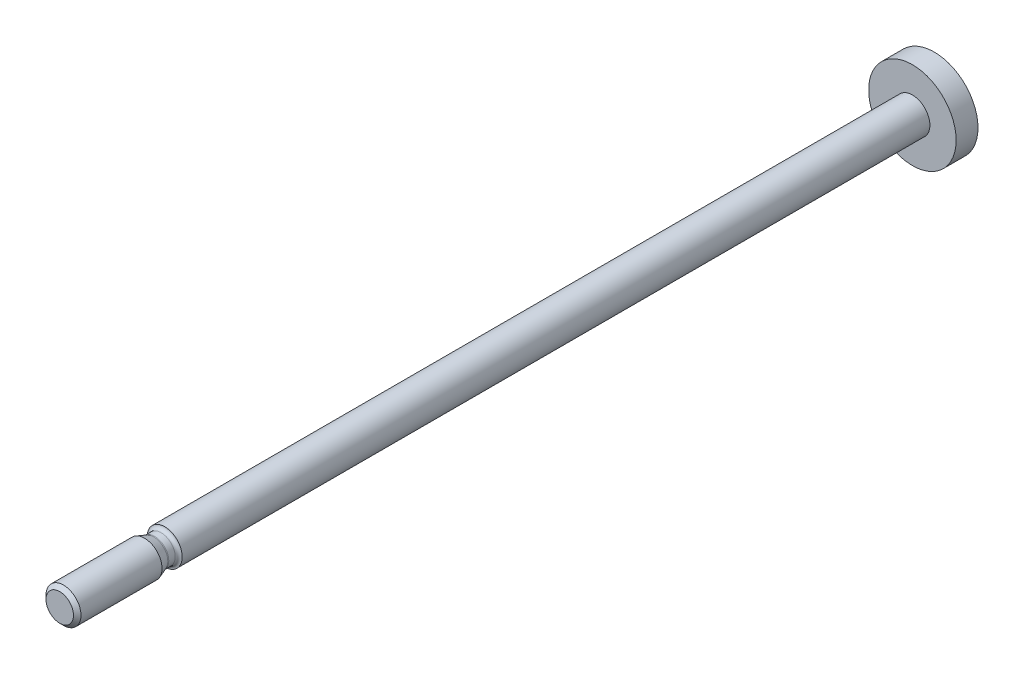
ISO-10303-21;
HEADER;
FILE_DESCRIPTION(('STEP AP214'),'2;1');
FILE_NAME('part.step','',(''),(''),'','','');
FILE_SCHEMA(('AUTOMOTIVE_DESIGN { 1 0 10303 214 1 1 1 1 }'));
ENDSEC;
DATA;
#1=APPLICATION_CONTEXT('core data for automotive mechanical design processes');
#2=APPLICATION_PROTOCOL_DEFINITION('international standard','automotive_design',2000,#1);
#3=PRODUCT_CONTEXT('',#1,'mechanical');
#4=PRODUCT('Part','Part','',(#3));
#5=PRODUCT_RELATED_PRODUCT_CATEGORY('part','',(#4));
#6=PRODUCT_DEFINITION_FORMATION('','',#4);
#7=PRODUCT_DEFINITION_CONTEXT('part definition',#1,'design');
#8=PRODUCT_DEFINITION('design','',#6,#7);
#9=PRODUCT_DEFINITION_SHAPE('','',#8);
#10=(LENGTH_UNIT() NAMED_UNIT(*) SI_UNIT(.MILLI.,.METRE.));
#11=(NAMED_UNIT(*) PLANE_ANGLE_UNIT() SI_UNIT($,.RADIAN.));
#12=(NAMED_UNIT(*) SI_UNIT($,.STERADIAN.) SOLID_ANGLE_UNIT());
#13=UNCERTAINTY_MEASURE_WITH_UNIT(LENGTH_MEASURE(1.E-05),#10,'distance_accuracy_value','');
#14=(GEOMETRIC_REPRESENTATION_CONTEXT(3) GLOBAL_UNCERTAINTY_ASSIGNED_CONTEXT((#13)) GLOBAL_UNIT_ASSIGNED_CONTEXT((#10,
#11,#12)) REPRESENTATION_CONTEXT('',''));
#15=CARTESIAN_POINT('',(0.,0.,0.));
#16=DIRECTION('',(0.,0.,1.));
#17=DIRECTION('',(1.,0.,0.));
#18=AXIS2_PLACEMENT_3D('',#15,#16,#17);
#19=CARTESIAN_POINT('',(0.,0.,-84.));
#20=DIRECTION('',(0.,0.,1.));
#21=DIRECTION('',(1.,0.,0.));
#22=AXIS2_PLACEMENT_3D('',#19,#20,#21);
#23=CYLINDRICAL_SURFACE('',#22,2.);
#24=CARTESIAN_POINT('',(0.,0.,4.));
#25=DIRECTION('',(0.,0.,1.));
#26=DIRECTION('',(1.,0.,0.));
#27=AXIS2_PLACEMENT_3D('',#24,#25,#26);
#28=CIRCLE('',#27,2.);
#29=CARTESIAN_POINT('',(2.,0.,4.));
#30=VERTEX_POINT('',#29);
#31=EDGE_CURVE('E10',#30,#30,#28,.T.);
#32=ORIENTED_EDGE('',*,*,#31,.F.);
#33=EDGE_LOOP('',(#32));
#34=FACE_BOUND('',#33,.T.);
#35=CARTESIAN_POINT('',(0.,0.,-81.5));
#36=DIRECTION('',(0.,0.,1.));
#37=DIRECTION('',(1.,0.,0.));
#38=AXIS2_PLACEMENT_3D('',#35,#36,#37);
#39=CIRCLE('',#38,2.);
#40=CARTESIAN_POINT('',(2.,0.,-81.5));
#41=VERTEX_POINT('',#40);
#42=EDGE_CURVE('E45',#41,#41,#39,.T.);
#43=ORIENTED_EDGE('',*,*,#42,.T.);
#44=EDGE_LOOP('',(#43));
#45=FACE_BOUND('',#44,.T.);
#46=ADVANCED_FACE('F39',(#34,#45),#23,.T.);
#47=CARTESIAN_POINT('',(0.,2.,-81.5));
#48=DIRECTION('',(0.,0.,-1.));
#49=DIRECTION('',(-1.,0.,0.));
#50=AXIS2_PLACEMENT_3D('',#47,#48,#49);
#51=PLANE('',#50);
#52=ORIENTED_EDGE('',*,*,#42,.F.);
#53=EDGE_LOOP('',(#52));
#54=FACE_BOUND('',#53,.T.);
#55=CARTESIAN_POINT('',(0.,0.,-81.5));
#56=DIRECTION('',(0.,0.,1.));
#57=DIRECTION('',(1.,0.,0.));
#58=AXIS2_PLACEMENT_3D('',#55,#56,#57);
#59=CIRCLE('',#58,5.);
#60=CARTESIAN_POINT('',(5.,0.,-81.5));
#61=VERTEX_POINT('',#60);
#62=EDGE_CURVE('E49',#61,#61,#59,.T.);
#63=ORIENTED_EDGE('',*,*,#62,.T.);
#64=EDGE_LOOP('',(#63));
#65=FACE_BOUND('',#64,.T.);
#66=ADVANCED_FACE('F121',(#54,#65),#51,.F.);
#67=CARTESIAN_POINT('',(0.,0.,-84.));
#68=DIRECTION('',(0.,0.,1.));
#69=DIRECTION('',(1.,0.,0.));
#70=AXIS2_PLACEMENT_3D('',#67,#68,#69);
#71=CYLINDRICAL_SURFACE('',#70,5.);
#72=ORIENTED_EDGE('',*,*,#62,.F.);
#73=EDGE_LOOP('',(#72));
#74=FACE_BOUND('',#73,.T.);
#75=CARTESIAN_POINT('',(0.,0.,-84.));
#76=DIRECTION('',(0.,0.,1.));
#77=DIRECTION('',(1.,0.,0.));
#78=AXIS2_PLACEMENT_3D('',#75,#76,#77);
#79=CIRCLE('',#78,5.);
#80=CARTESIAN_POINT('',(5.,0.,-84.));
#81=VERTEX_POINT('',#80);
#82=EDGE_CURVE('E53',#81,#81,#79,.T.);
#83=ORIENTED_EDGE('',*,*,#82,.T.);
#84=EDGE_LOOP('',(#83));
#85=FACE_BOUND('',#84,.T.);
#86=ADVANCED_FACE('F117',(#74,#85),#71,.T.);
#87=CARTESIAN_POINT('',(0.,5.,-84.));
#88=DIRECTION('',(0.,0.,1.));
#89=DIRECTION('',(1.,0.,0.));
#90=AXIS2_PLACEMENT_3D('',#87,#88,#89);
#91=PLANE('',#90);
#92=ORIENTED_EDGE('',*,*,#82,.F.);
#93=EDGE_LOOP('',(#92));
#94=FACE_BOUND('',#93,.T.);
#95=ADVANCED_FACE('F111',(#94),#91,.F.);
#96=CARTESIAN_POINT('',(0.,0.,4.40000000000006));
#97=DIRECTION('',(0.,0.,1.));
#98=DIRECTION('',(1.,0.,0.));
#99=AXIS2_PLACEMENT_3D('',#96,#97,#98);
#100=TOROIDAL_SURFACE('',#99,2.00000000000006,0.400000000000064);
#101=CARTESIAN_POINT('',(0.,0.,4.4));
#102=DIRECTION('',(0.,0.,1.));
#103=DIRECTION('',(1.,0.,0.));
#104=AXIS2_PLACEMENT_3D('',#101,#102,#103);
#105=CIRCLE('',#104,1.6);
#106=CARTESIAN_POINT('',(1.6,0.,4.4));
#107=VERTEX_POINT('',#106);
#108=EDGE_CURVE('E58',#107,#107,#105,.T.);
#109=ORIENTED_EDGE('',*,*,#108,.F.);
#110=EDGE_LOOP('',(#109));
#111=FACE_BOUND('',#110,.T.);
#112=ORIENTED_EDGE('',*,*,#31,.T.);
#113=EDGE_LOOP('',(#112));
#114=FACE_BOUND('',#113,.T.);
#115=ADVANCED_FACE('F106',(#111,#114),#100,.F.);
#116=CARTESIAN_POINT('',(0.,0.,3.));
#117=DIRECTION('',(0.,0.,1.));
#118=DIRECTION('',(1.,0.,0.));
#119=AXIS2_PLACEMENT_3D('',#116,#117,#118);
#120=CYLINDRICAL_SURFACE('',#119,1.6);
#121=CARTESIAN_POINT('',(0.,0.,5.1294692077166));
#122=DIRECTION('',(0.,0.,1.));
#123=DIRECTION('',(1.,0.,0.));
#124=AXIS2_PLACEMENT_3D('',#121,#122,#123);
#125=CIRCLE('',#124,1.6);
#126=CARTESIAN_POINT('',(1.6,0.,5.1294692077166));
#127=VERTEX_POINT('',#126);
#128=EDGE_CURVE('E61',#127,#127,#125,.T.);
#129=ORIENTED_EDGE('',*,*,#128,.F.);
#130=EDGE_LOOP('',(#129));
#131=FACE_BOUND('',#130,.T.);
#132=ORIENTED_EDGE('',*,*,#108,.T.);
#133=EDGE_LOOP('',(#132));
#134=FACE_BOUND('',#133,.T.);
#135=ADVANCED_FACE('F100',(#131,#134),#120,.T.);
#136=CARTESIAN_POINT('',(0.,0.,5.12946920771671));
#137=DIRECTION('',(0.,0.,1.));
#138=DIRECTION('',(1.,0.,0.));
#139=AXIS2_PLACEMENT_3D('',#136,#137,#138);
#140=TOROIDAL_SURFACE('',#139,2.00000000000013,0.400000000000127);
#141=CARTESIAN_POINT('',(0.,0.,5.2662772650469));
#142=DIRECTION('',(0.,0.,1.));
#143=DIRECTION('',(1.,0.,0.));
#144=AXIS2_PLACEMENT_3D('',#141,#142,#143);
#145=CIRCLE('',#144,1.6241229516856);
#146=CARTESIAN_POINT('',(1.6241229516856,0.,5.2662772650469));
#147=VERTEX_POINT('',#146);
#148=EDGE_CURVE('E64',#147,#147,#145,.T.);
#149=ORIENTED_EDGE('',*,*,#148,.F.);
#150=EDGE_LOOP('',(#149));
#151=FACE_BOUND('',#150,.T.);
#152=ORIENTED_EDGE('',*,*,#128,.T.);
#153=EDGE_LOOP('',(#152));
#154=FACE_BOUND('',#153,.T.);
#155=ADVANCED_FACE('F94',(#151,#154),#140,.F.);
#156=CARTESIAN_POINT('',(0.,0.,5.2662772650469));
#157=DIRECTION('',(0.,0.,1.));
#158=DIRECTION('',(1.,0.,0.));
#159=AXIS2_PLACEMENT_3D('',#156,#157,#158);
#160=CONICAL_SURFACE('',#159,1.6241229516856,0.349065850398918);
#161=CARTESIAN_POINT('',(0.,0.,6.2989909677818));
#162=DIRECTION('',(0.,0.,1.));
#163=DIRECTION('',(1.,0.,0.));
#164=AXIS2_PLACEMENT_3D('',#161,#162,#163);
#165=CIRCLE('',#164,2.);
#166=CARTESIAN_POINT('',(2.,0.,6.2989909677818));
#167=VERTEX_POINT('',#166);
#168=EDGE_CURVE('E67',#167,#167,#165,.T.);
#169=ORIENTED_EDGE('',*,*,#168,.F.);
#170=EDGE_LOOP('',(#169));
#171=FACE_BOUND('',#170,.T.);
#172=ORIENTED_EDGE('',*,*,#148,.T.);
#173=EDGE_LOOP('',(#172));
#174=FACE_BOUND('',#173,.T.);
#175=ADVANCED_FACE('F88',(#171,#174),#160,.T.);
#176=CARTESIAN_POINT('',(0.,0.,3.));
#177=DIRECTION('',(0.,0.,1.));
#178=DIRECTION('',(1.,0.,0.));
#179=AXIS2_PLACEMENT_3D('',#176,#177,#178);
#180=CYLINDRICAL_SURFACE('',#179,2.);
#181=CARTESIAN_POINT('',(0.,0.,15.5705));
#182=DIRECTION('',(0.,0.,1.));
#183=DIRECTION('',(1.,0.,0.));
#184=AXIS2_PLACEMENT_3D('',#181,#182,#183);
#185=CIRCLE('',#184,2.);
#186=CARTESIAN_POINT('',(2.,0.,15.5705));
#187=VERTEX_POINT('',#186);
#188=EDGE_CURVE('E70',#187,#187,#185,.T.);
#189=ORIENTED_EDGE('',*,*,#188,.F.);
#190=EDGE_LOOP('',(#189));
#191=FACE_BOUND('',#190,.T.);
#192=ORIENTED_EDGE('',*,*,#168,.T.);
#193=EDGE_LOOP('',(#192));
#194=FACE_BOUND('',#193,.T.);
#195=ADVANCED_FACE('F82',(#191,#194),#180,.T.);
#196=CARTESIAN_POINT('',(0.,0.,15.5705));
#197=DIRECTION('',(0.,0.,-1.));
#198=DIRECTION('',(-1.,0.,0.));
#199=AXIS2_PLACEMENT_3D('',#196,#197,#198);
#200=CONICAL_SURFACE('',#199,2.,0.785398163397445);
#201=CARTESIAN_POINT('',(0.,0.,16.));
#202=DIRECTION('',(0.,0.,1.));
#203=DIRECTION('',(1.,0.,0.));
#204=AXIS2_PLACEMENT_3D('',#201,#202,#203);
#205=CIRCLE('',#204,1.5705);
#206=CARTESIAN_POINT('',(1.5705,0.,16.));
#207=VERTEX_POINT('',#206);
#208=EDGE_CURVE('E73',#207,#207,#205,.T.);
#209=ORIENTED_EDGE('',*,*,#208,.F.);
#210=EDGE_LOOP('',(#209));
#211=FACE_BOUND('',#210,.T.);
#212=ORIENTED_EDGE('',*,*,#188,.T.);
#213=EDGE_LOOP('',(#212));
#214=FACE_BOUND('',#213,.T.);
#215=ADVANCED_FACE('F79',(#211,#214),#200,.T.);
#216=CARTESIAN_POINT('',(0.,0.,16.));
#217=DIRECTION('',(0.,0.,-1.));
#218=DIRECTION('',(-1.,0.,0.));
#219=AXIS2_PLACEMENT_3D('',#216,#217,#218);
#220=PLANE('',#219);
#221=ORIENTED_EDGE('',*,*,#208,.T.);
#222=EDGE_LOOP('',(#221));
#223=FACE_BOUND('',#222,.T.);
#224=ADVANCED_FACE('F77',(#223),#220,.F.);
#225=CLOSED_SHELL('',(#46,#66,#86,#95,#115,#135,#155,#175,#195,#215,#224));
#226=MANIFOLD_SOLID_BREP('B2',#225);
#227=ADVANCED_BREP_SHAPE_REPRESENTATION('',(#18,#226),#14);
#228=SHAPE_DEFINITION_REPRESENTATION(#9,#227);
ENDSEC;
END-ISO-10303-21;
